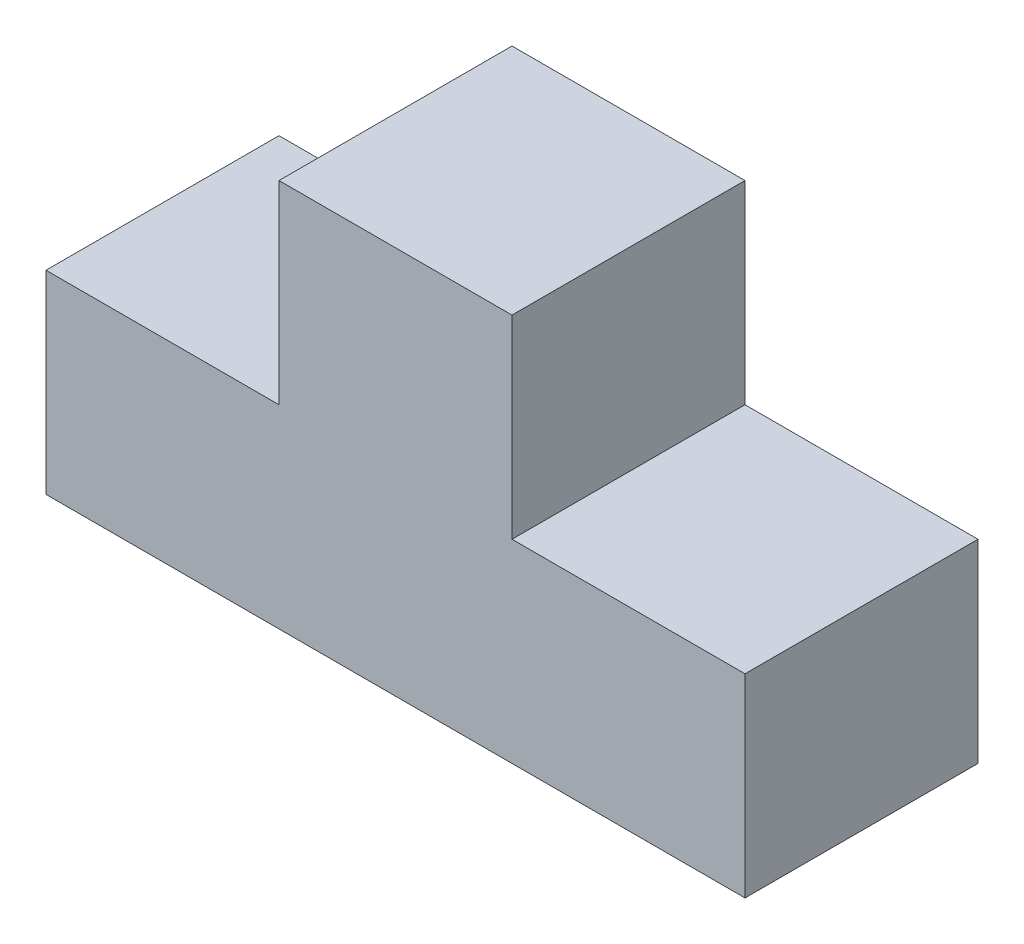
ISO-10303-21;
HEADER;
FILE_DESCRIPTION(('STEP AP214'),'2;1');
FILE_NAME('part.step','',(''),(''),'','','');
FILE_SCHEMA(('AUTOMOTIVE_DESIGN { 1 0 10303 214 1 1 1 1 }'));
ENDSEC;
DATA;
#1=APPLICATION_CONTEXT('core data for automotive mechanical design processes');
#2=APPLICATION_PROTOCOL_DEFINITION('international standard','automotive_design',2000,#1);
#3=PRODUCT_CONTEXT('',#1,'mechanical');
#4=PRODUCT('Part','Part','',(#3));
#5=PRODUCT_RELATED_PRODUCT_CATEGORY('part','',(#4));
#6=PRODUCT_DEFINITION_FORMATION('','',#4);
#7=PRODUCT_DEFINITION_CONTEXT('part definition',#1,'design');
#8=PRODUCT_DEFINITION('design','',#6,#7);
#9=PRODUCT_DEFINITION_SHAPE('','',#8);
#10=(LENGTH_UNIT() NAMED_UNIT(*) SI_UNIT(.MILLI.,.METRE.));
#11=(NAMED_UNIT(*) PLANE_ANGLE_UNIT() SI_UNIT($,.RADIAN.));
#12=(NAMED_UNIT(*) SI_UNIT($,.STERADIAN.) SOLID_ANGLE_UNIT());
#13=UNCERTAINTY_MEASURE_WITH_UNIT(LENGTH_MEASURE(1.E-05),#10,'distance_accuracy_value','');
#14=(GEOMETRIC_REPRESENTATION_CONTEXT(3) GLOBAL_UNCERTAINTY_ASSIGNED_CONTEXT((#13)) GLOBAL_UNIT_ASSIGNED_CONTEXT((#10,
#11,#12)) REPRESENTATION_CONTEXT('',''));
#15=CARTESIAN_POINT('',(0.,0.,0.));
#16=DIRECTION('',(0.,0.,1.));
#17=DIRECTION('',(1.,0.,0.));
#18=AXIS2_PLACEMENT_3D('',#15,#16,#17);
#19=CARTESIAN_POINT('',(45.,0.,30.));
#20=DIRECTION('',(-1.,0.,0.));
#21=DIRECTION('',(0.,0.,1.));
#22=AXIS2_PLACEMENT_3D('',#19,#20,#21);
#23=PLANE('',#22);
#24=DIRECTION('',(0.,1.,0.));
#25=VECTOR('',#24,1.);
#26=CARTESIAN_POINT('',(45.,0.,0.));
#27=LINE('',#26,#25);
#28=CARTESIAN_POINT('',(45.,0.,0.));
#29=VERTEX_POINT('',#28);
#30=CARTESIAN_POINT('',(45.,25.,0.));
#31=VERTEX_POINT('',#30);
#32=EDGE_CURVE('E129',#29,#31,#27,.T.);
#33=ORIENTED_EDGE('',*,*,#32,.T.);
#34=DIRECTION('',(0.,0.,-1.));
#35=VECTOR('',#34,1.);
#36=CARTESIAN_POINT('',(45.,25.,30.));
#37=LINE('',#36,#35);
#38=CARTESIAN_POINT('',(45.,25.,30.));
#39=VERTEX_POINT('',#38);
#40=EDGE_CURVE('E11',#39,#31,#37,.T.);
#41=ORIENTED_EDGE('',*,*,#40,.F.);
#42=DIRECTION('',(0.,1.,0.));
#43=VECTOR('',#42,1.);
#44=CARTESIAN_POINT('',(45.,0.,30.));
#45=LINE('',#44,#43);
#46=CARTESIAN_POINT('',(45.,0.,30.));
#47=VERTEX_POINT('',#46);
#48=EDGE_CURVE('E143',#47,#39,#45,.T.);
#49=ORIENTED_EDGE('',*,*,#48,.F.);
#50=DIRECTION('',(0.,0.,-1.));
#51=VECTOR('',#50,1.);
#52=CARTESIAN_POINT('',(45.,0.,30.));
#53=LINE('',#52,#51);
#54=EDGE_CURVE('E125',#47,#29,#53,.T.);
#55=ORIENTED_EDGE('',*,*,#54,.T.);
#56=EDGE_LOOP('',(#33,#41,#49,#55));
#57=FACE_BOUND('',#56,.T.);
#58=ADVANCED_FACE('F33',(#57),#23,.F.);
#59=CARTESIAN_POINT('',(45.,25.,30.));
#60=DIRECTION('',(0.,-1.,0.));
#61=DIRECTION('',(1.,0.,0.));
#62=AXIS2_PLACEMENT_3D('',#59,#60,#61);
#63=PLANE('',#62);
#64=DIRECTION('',(-1.,0.,0.));
#65=VECTOR('',#64,1.);
#66=CARTESIAN_POINT('',(45.,25.,0.));
#67=LINE('',#66,#65);
#68=CARTESIAN_POINT('',(15.,25.,0.));
#69=VERTEX_POINT('',#68);
#70=EDGE_CURVE('E132',#31,#69,#67,.T.);
#71=ORIENTED_EDGE('',*,*,#70,.T.);
#72=DIRECTION('',(0.,0.,-1.));
#73=VECTOR('',#72,1.);
#74=CARTESIAN_POINT('',(15.,25.,30.));
#75=LINE('',#74,#73);
#76=CARTESIAN_POINT('',(15.,25.,30.));
#77=VERTEX_POINT('',#76);
#78=EDGE_CURVE('E41',#77,#69,#75,.T.);
#79=ORIENTED_EDGE('',*,*,#78,.F.);
#80=DIRECTION('',(-1.,0.,0.));
#81=VECTOR('',#80,1.);
#82=CARTESIAN_POINT('',(45.,25.,30.));
#83=LINE('',#82,#81);
#84=EDGE_CURVE('E92',#39,#77,#83,.T.);
#85=ORIENTED_EDGE('',*,*,#84,.F.);
#86=ORIENTED_EDGE('',*,*,#40,.T.);
#87=EDGE_LOOP('',(#71,#79,#85,#86));
#88=FACE_BOUND('',#87,.T.);
#89=ADVANCED_FACE('F178',(#88),#63,.F.);
#90=CARTESIAN_POINT('',(15.,25.,30.));
#91=DIRECTION('',(-1.,0.,0.));
#92=DIRECTION('',(0.,0.,1.));
#93=AXIS2_PLACEMENT_3D('',#90,#91,#92);
#94=PLANE('',#93);
#95=DIRECTION('',(0.,1.,0.));
#96=VECTOR('',#95,1.);
#97=CARTESIAN_POINT('',(15.,25.,0.));
#98=LINE('',#97,#96);
#99=CARTESIAN_POINT('',(15.,50.,0.));
#100=VERTEX_POINT('',#99);
#101=EDGE_CURVE('E134',#69,#100,#98,.T.);
#102=ORIENTED_EDGE('',*,*,#101,.T.);
#103=DIRECTION('',(0.,0.,-1.));
#104=VECTOR('',#103,1.);
#105=CARTESIAN_POINT('',(15.,50.,30.));
#106=LINE('',#105,#104);
#107=CARTESIAN_POINT('',(15.,50.,30.));
#108=VERTEX_POINT('',#107);
#109=EDGE_CURVE('E150',#108,#100,#106,.T.);
#110=ORIENTED_EDGE('',*,*,#109,.F.);
#111=DIRECTION('',(0.,1.,0.));
#112=VECTOR('',#111,1.);
#113=CARTESIAN_POINT('',(15.,25.,30.));
#114=LINE('',#113,#112);
#115=EDGE_CURVE('E158',#77,#108,#114,.T.);
#116=ORIENTED_EDGE('',*,*,#115,.F.);
#117=ORIENTED_EDGE('',*,*,#78,.T.);
#118=EDGE_LOOP('',(#102,#110,#116,#117));
#119=FACE_BOUND('',#118,.T.);
#120=ADVANCED_FACE('F156',(#119),#94,.F.);
#121=CARTESIAN_POINT('',(15.,50.,30.));
#122=DIRECTION('',(0.,-1.,0.));
#123=DIRECTION('',(0.,0.,-1.));
#124=AXIS2_PLACEMENT_3D('',#121,#122,#123);
#125=PLANE('',#124);
#126=DIRECTION('',(-1.,0.,0.));
#127=VECTOR('',#126,1.);
#128=CARTESIAN_POINT('',(15.,50.,0.));
#129=LINE('',#128,#127);
#130=CARTESIAN_POINT('',(-15.,50.,0.));
#131=VERTEX_POINT('',#130);
#132=EDGE_CURVE('E136',#100,#131,#129,.T.);
#133=ORIENTED_EDGE('',*,*,#132,.T.);
#134=DIRECTION('',(0.,0.,-1.));
#135=VECTOR('',#134,1.);
#136=CARTESIAN_POINT('',(-15.,50.,30.));
#137=LINE('',#136,#135);
#138=CARTESIAN_POINT('',(-15.,50.,30.));
#139=VERTEX_POINT('',#138);
#140=EDGE_CURVE('E147',#139,#131,#137,.T.);
#141=ORIENTED_EDGE('',*,*,#140,.F.);
#142=DIRECTION('',(-1.,0.,0.));
#143=VECTOR('',#142,1.);
#144=CARTESIAN_POINT('',(15.,50.,30.));
#145=LINE('',#144,#143);
#146=EDGE_CURVE('E170',#108,#139,#145,.T.);
#147=ORIENTED_EDGE('',*,*,#146,.F.);
#148=ORIENTED_EDGE('',*,*,#109,.T.);
#149=EDGE_LOOP('',(#133,#141,#147,#148));
#150=FACE_BOUND('',#149,.T.);
#151=ADVANCED_FACE('F166',(#150),#125,.F.);
#152=CARTESIAN_POINT('',(-15.,25.,30.));
#153=DIRECTION('',(1.,0.,0.));
#154=DIRECTION('',(0.,0.,-1.));
#155=AXIS2_PLACEMENT_3D('',#152,#153,#154);
#156=PLANE('',#155);
#157=DIRECTION('',(0.,-1.,0.));
#158=VECTOR('',#157,1.);
#159=CARTESIAN_POINT('',(-15.,25.,0.));
#160=LINE('',#159,#158);
#161=CARTESIAN_POINT('',(-15.,25.,0.));
#162=VERTEX_POINT('',#161);
#163=EDGE_CURVE('E138',#131,#162,#160,.T.);
#164=ORIENTED_EDGE('',*,*,#163,.T.);
#165=DIRECTION('',(0.,0.,-1.));
#166=VECTOR('',#165,1.);
#167=CARTESIAN_POINT('',(-15.,25.,30.));
#168=LINE('',#167,#166);
#169=CARTESIAN_POINT('',(-15.,25.,30.));
#170=VERTEX_POINT('',#169);
#171=EDGE_CURVE('E120',#170,#162,#168,.T.);
#172=ORIENTED_EDGE('',*,*,#171,.F.);
#173=DIRECTION('',(0.,-1.,0.));
#174=VECTOR('',#173,1.);
#175=CARTESIAN_POINT('',(-15.,25.,30.));
#176=LINE('',#175,#174);
#177=EDGE_CURVE('E111',#139,#170,#176,.T.);
#178=ORIENTED_EDGE('',*,*,#177,.F.);
#179=ORIENTED_EDGE('',*,*,#140,.T.);
#180=EDGE_LOOP('',(#164,#172,#178,#179));
#181=FACE_BOUND('',#180,.T.);
#182=ADVANCED_FACE('F169',(#181),#156,.F.);
#183=CARTESIAN_POINT('',(-45.,25.,30.));
#184=DIRECTION('',(0.,-1.,0.));
#185=DIRECTION('',(1.,0.,0.));
#186=AXIS2_PLACEMENT_3D('',#183,#184,#185);
#187=PLANE('',#186);
#188=DIRECTION('',(-1.,0.,0.));
#189=VECTOR('',#188,1.);
#190=CARTESIAN_POINT('',(-45.,25.,0.));
#191=LINE('',#190,#189);
#192=CARTESIAN_POINT('',(-45.,25.,0.));
#193=VERTEX_POINT('',#192);
#194=EDGE_CURVE('E119',#162,#193,#191,.T.);
#195=ORIENTED_EDGE('',*,*,#194,.T.);
#196=DIRECTION('',(0.,0.,-1.));
#197=VECTOR('',#196,1.);
#198=CARTESIAN_POINT('',(-45.,25.,30.));
#199=LINE('',#198,#197);
#200=CARTESIAN_POINT('',(-45.,25.,30.));
#201=VERTEX_POINT('',#200);
#202=EDGE_CURVE('E116',#201,#193,#199,.T.);
#203=ORIENTED_EDGE('',*,*,#202,.F.);
#204=DIRECTION('',(-1.,0.,0.));
#205=VECTOR('',#204,1.);
#206=CARTESIAN_POINT('',(-45.,25.,30.));
#207=LINE('',#206,#205);
#208=EDGE_CURVE('E105',#170,#201,#207,.T.);
#209=ORIENTED_EDGE('',*,*,#208,.F.);
#210=ORIENTED_EDGE('',*,*,#171,.T.);
#211=EDGE_LOOP('',(#195,#203,#209,#210));
#212=FACE_BOUND('',#211,.T.);
#213=ADVANCED_FACE('F117',(#212),#187,.F.);
#214=CARTESIAN_POINT('',(-45.,0.,30.));
#215=DIRECTION('',(1.,0.,0.));
#216=DIRECTION('',(0.,0.,-1.));
#217=AXIS2_PLACEMENT_3D('',#214,#215,#216);
#218=PLANE('',#217);
#219=DIRECTION('',(0.,-1.,0.));
#220=VECTOR('',#219,1.);
#221=CARTESIAN_POINT('',(-45.,0.,0.));
#222=LINE('',#221,#220);
#223=CARTESIAN_POINT('',(-45.,0.,0.));
#224=VERTEX_POINT('',#223);
#225=EDGE_CURVE('E78',#193,#224,#222,.T.);
#226=ORIENTED_EDGE('',*,*,#225,.T.);
#227=DIRECTION('',(0.,0.,-1.));
#228=VECTOR('',#227,1.);
#229=CARTESIAN_POINT('',(-45.,0.,30.));
#230=LINE('',#229,#228);
#231=CARTESIAN_POINT('',(-45.,0.,30.));
#232=VERTEX_POINT('',#231);
#233=EDGE_CURVE('E121',#232,#224,#230,.T.);
#234=ORIENTED_EDGE('',*,*,#233,.F.);
#235=DIRECTION('',(0.,-1.,0.));
#236=VECTOR('',#235,1.);
#237=CARTESIAN_POINT('',(-45.,0.,30.));
#238=LINE('',#237,#236);
#239=EDGE_CURVE('E109',#201,#232,#238,.T.);
#240=ORIENTED_EDGE('',*,*,#239,.F.);
#241=ORIENTED_EDGE('',*,*,#202,.T.);
#242=EDGE_LOOP('',(#226,#234,#240,#241));
#243=FACE_BOUND('',#242,.T.);
#244=ADVANCED_FACE('F123',(#243),#218,.F.);
#245=CARTESIAN_POINT('',(-45.,0.,30.));
#246=DIRECTION('',(0.,1.,0.));
#247=DIRECTION('',(0.,0.,1.));
#248=AXIS2_PLACEMENT_3D('',#245,#246,#247);
#249=PLANE('',#248);
#250=DIRECTION('',(1.,0.,0.));
#251=VECTOR('',#250,1.);
#252=CARTESIAN_POINT('',(-45.,0.,0.));
#253=LINE('',#252,#251);
#254=EDGE_CURVE('E84',#224,#29,#253,.T.);
#255=ORIENTED_EDGE('',*,*,#254,.T.);
#256=ORIENTED_EDGE('',*,*,#54,.F.);
#257=DIRECTION('',(1.,0.,0.));
#258=VECTOR('',#257,1.);
#259=CARTESIAN_POINT('',(-45.,0.,30.));
#260=LINE('',#259,#258);
#261=EDGE_CURVE('E49',#232,#47,#260,.T.);
#262=ORIENTED_EDGE('',*,*,#261,.F.);
#263=ORIENTED_EDGE('',*,*,#233,.T.);
#264=EDGE_LOOP('',(#255,#256,#262,#263));
#265=FACE_BOUND('',#264,.T.);
#266=ADVANCED_FACE('F194',(#265),#249,.F.);
#267=CARTESIAN_POINT('',(0.,0.,30.));
#268=DIRECTION('',(0.,0.,1.));
#269=DIRECTION('',(1.,0.,0.));
#270=AXIS2_PLACEMENT_3D('',#267,#268,#269);
#271=PLANE('',#270);
#272=ORIENTED_EDGE('',*,*,#48,.T.);
#273=ORIENTED_EDGE('',*,*,#84,.T.);
#274=ORIENTED_EDGE('',*,*,#115,.T.);
#275=ORIENTED_EDGE('',*,*,#146,.T.);
#276=ORIENTED_EDGE('',*,*,#177,.T.);
#277=ORIENTED_EDGE('',*,*,#208,.T.);
#278=ORIENTED_EDGE('',*,*,#239,.T.);
#279=ORIENTED_EDGE('',*,*,#261,.T.);
#280=EDGE_LOOP('',(#272,#273,#274,#275,#276,#277,#278,#279));
#281=FACE_BOUND('',#280,.T.);
#282=ADVANCED_FACE('F107',(#281),#271,.T.);
#283=CARTESIAN_POINT('',(0.,0.,0.));
#284=DIRECTION('',(0.,0.,1.));
#285=DIRECTION('',(1.,0.,0.));
#286=AXIS2_PLACEMENT_3D('',#283,#284,#285);
#287=PLANE('',#286);
#288=ORIENTED_EDGE('',*,*,#32,.F.);
#289=ORIENTED_EDGE('',*,*,#254,.F.);
#290=ORIENTED_EDGE('',*,*,#225,.F.);
#291=ORIENTED_EDGE('',*,*,#194,.F.);
#292=ORIENTED_EDGE('',*,*,#163,.F.);
#293=ORIENTED_EDGE('',*,*,#132,.F.);
#294=ORIENTED_EDGE('',*,*,#101,.F.);
#295=ORIENTED_EDGE('',*,*,#70,.F.);
#296=EDGE_LOOP('',(#288,#289,#290,#291,#292,#293,#294,#295));
#297=FACE_BOUND('',#296,.T.);
#298=ADVANCED_FACE('F162',(#297),#287,.F.);
#299=CLOSED_SHELL('',(#58,#89,#120,#151,#182,#213,#244,#266,#282,#298));
#300=MANIFOLD_SOLID_BREP('B2',#299);
#301=ADVANCED_BREP_SHAPE_REPRESENTATION('',(#18,#300),#14);
#302=SHAPE_DEFINITION_REPRESENTATION(#9,#301);
ENDSEC;
END-ISO-10303-21;
